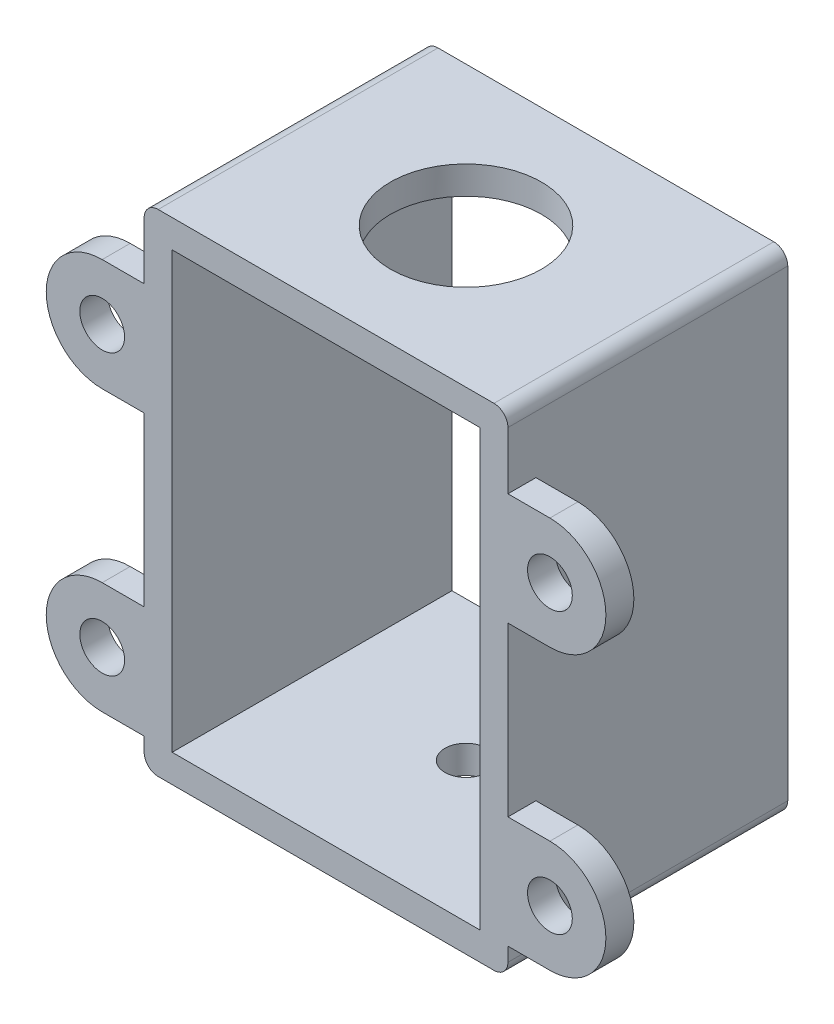
ISO-10303-21;
HEADER;
FILE_DESCRIPTION(('STEP AP214'),'2;1');
FILE_NAME('part.step','',(''),(''),'','','');
FILE_SCHEMA(('AUTOMOTIVE_DESIGN { 1 0 10303 214 1 1 1 1 }'));
ENDSEC;
DATA;
#1=APPLICATION_CONTEXT('core data for automotive mechanical design processes');
#2=APPLICATION_PROTOCOL_DEFINITION('international standard','automotive_design',2000,#1);
#3=PRODUCT_CONTEXT('',#1,'mechanical');
#4=PRODUCT('Part','Part','',(#3));
#5=PRODUCT_RELATED_PRODUCT_CATEGORY('part','',(#4));
#6=PRODUCT_DEFINITION_FORMATION('','',#4);
#7=PRODUCT_DEFINITION_CONTEXT('part definition',#1,'design');
#8=PRODUCT_DEFINITION('design','',#6,#7);
#9=PRODUCT_DEFINITION_SHAPE('','',#8);
#10=(LENGTH_UNIT() NAMED_UNIT(*) SI_UNIT(.MILLI.,.METRE.));
#11=(NAMED_UNIT(*) PLANE_ANGLE_UNIT() SI_UNIT($,.RADIAN.));
#12=(NAMED_UNIT(*) SI_UNIT($,.STERADIAN.) SOLID_ANGLE_UNIT());
#13=UNCERTAINTY_MEASURE_WITH_UNIT(LENGTH_MEASURE(1.E-05),#10,'distance_accuracy_value','');
#14=(GEOMETRIC_REPRESENTATION_CONTEXT(3) GLOBAL_UNCERTAINTY_ASSIGNED_CONTEXT((#13)) GLOBAL_UNIT_ASSIGNED_CONTEXT((#10,
#11,#12)) REPRESENTATION_CONTEXT('',''));
#15=CARTESIAN_POINT('',(0.,0.,0.));
#16=DIRECTION('',(0.,0.,1.));
#17=DIRECTION('',(1.,0.,0.));
#18=AXIS2_PLACEMENT_3D('',#15,#16,#17);
#19=CARTESIAN_POINT('',(0.,0.,20.));
#20=DIRECTION('',(0.,0.,-1.));
#21=DIRECTION('',(-1.,0.,0.));
#22=AXIS2_PLACEMENT_3D('',#19,#20,#21);
#23=PLANE('',#22);
#24=DIRECTION('',(1.,0.,0.));
#25=VECTOR('',#24,1.);
#26=CARTESIAN_POINT('',(0.,-31.1,20.));
#27=LINE('',#26,#25);
#28=CARTESIAN_POINT('',(0.,-31.1,20.));
#29=VERTEX_POINT('',#28);
#30=CARTESIAN_POINT('',(22.,-31.1,20.));
#31=VERTEX_POINT('',#30);
#32=EDGE_CURVE('E371',#29,#31,#27,.T.);
#33=ORIENTED_EDGE('',*,*,#32,.F.);
#34=DIRECTION('',(0.,-1.,0.));
#35=VECTOR('',#34,1.);
#36=CARTESIAN_POINT('',(0.,-31.5,20.));
#37=LINE('',#36,#35);
#38=CARTESIAN_POINT('',(0.,0.,20.));
#39=VERTEX_POINT('',#38);
#40=EDGE_CURVE('E384',#39,#29,#37,.T.);
#41=ORIENTED_EDGE('',*,*,#40,.F.);
#42=DIRECTION('',(-1.,0.,0.));
#43=VECTOR('',#42,1.);
#44=CARTESIAN_POINT('',(0.,0.,20.));
#45=LINE('',#44,#43);
#46=CARTESIAN_POINT('',(22.,0.,20.));
#47=VERTEX_POINT('',#46);
#48=EDGE_CURVE('E389',#47,#39,#45,.T.);
#49=ORIENTED_EDGE('',*,*,#48,.F.);
#50=DIRECTION('',(0.,1.,0.));
#51=VECTOR('',#50,1.);
#52=CARTESIAN_POINT('',(22.,0.,20.));
#53=LINE('',#52,#51);
#54=EDGE_CURVE('E386',#31,#47,#53,.T.);
#55=ORIENTED_EDGE('',*,*,#54,.F.);
#56=EDGE_LOOP('',(#33,#41,#49,#55));
#57=FACE_BOUND('',#56,.T.);
#58=DIRECTION('',(0.,-1.,0.));
#59=VECTOR('',#58,1.);
#60=CARTESIAN_POINT('',(-1.99999999999999,-33.5,20.));
#61=LINE('',#60,#59);
#62=CARTESIAN_POINT('',(-1.99999999999999,-11.1,20.));
#63=VERTEX_POINT('',#62);
#64=CARTESIAN_POINT('',(-1.99999999999999,-23.1,20.));
#65=VERTEX_POINT('',#64);
#66=EDGE_CURVE('E418',#63,#65,#61,.T.);
#67=ORIENTED_EDGE('',*,*,#66,.T.);
#68=DIRECTION('',(-1.,0.,0.));
#69=VECTOR('',#68,1.);
#70=CARTESIAN_POINT('',(-5.,-23.1,20.));
#71=LINE('',#70,#69);
#72=CARTESIAN_POINT('',(-5.,-23.1,20.));
#73=VERTEX_POINT('',#72);
#74=EDGE_CURVE('E241',#65,#73,#71,.T.);
#75=ORIENTED_EDGE('',*,*,#74,.T.);
#76=CARTESIAN_POINT('',(-5.,-27.1,20.));
#77=DIRECTION('',(0.,0.,1.));
#78=DIRECTION('',(-1.,0.,0.));
#79=AXIS2_PLACEMENT_3D('',#76,#77,#78);
#80=CIRCLE('',#79,4.);
#81=CARTESIAN_POINT('',(-5.,-31.1,20.));
#82=VERTEX_POINT('',#81);
#83=EDGE_CURVE('E249',#73,#82,#80,.T.);
#84=ORIENTED_EDGE('',*,*,#83,.T.);
#85=DIRECTION('',(1.,0.,0.));
#86=VECTOR('',#85,1.);
#87=CARTESIAN_POINT('',(0.,-31.1,20.));
#88=LINE('',#87,#86);
#89=CARTESIAN_POINT('',(-1.99999999999999,-31.1,20.));
#90=VERTEX_POINT('',#89);
#91=EDGE_CURVE('E48',#82,#90,#88,.T.);
#92=ORIENTED_EDGE('',*,*,#91,.T.);
#93=CARTESIAN_POINT('',(-1.99999999999999,-32.1,20.));
#94=VERTEX_POINT('',#93);
#95=EDGE_CURVE('E413',#90,#94,#61,.T.);
#96=ORIENTED_EDGE('',*,*,#95,.T.);
#97=CARTESIAN_POINT('',(-0.999999999999994,-32.1,20.));
#98=DIRECTION('',(0.,0.,-1.));
#99=DIRECTION('',(-1.,0.,0.));
#100=AXIS2_PLACEMENT_3D('',#97,#98,#99);
#101=CIRCLE('',#100,1.);
#102=CARTESIAN_POINT('',(-0.999999999999994,-33.1,20.));
#103=VERTEX_POINT('',#102);
#104=EDGE_CURVE('E436',#94,#103,#101,.F.);
#105=ORIENTED_EDGE('',*,*,#104,.T.);
#106=DIRECTION('',(-1.,0.,0.));
#107=VECTOR('',#106,1.);
#108=CARTESIAN_POINT('',(0.,-33.1,20.));
#109=LINE('',#108,#107);
#110=CARTESIAN_POINT('',(23.,-33.1,20.));
#111=VERTEX_POINT('',#110);
#112=EDGE_CURVE('E365',#111,#103,#109,.T.);
#113=ORIENTED_EDGE('',*,*,#112,.F.);
#114=CARTESIAN_POINT('',(23.,-32.1,20.));
#115=DIRECTION('',(0.,0.,-1.));
#116=DIRECTION('',(-1.,0.,0.));
#117=AXIS2_PLACEMENT_3D('',#114,#115,#116);
#118=CIRCLE('',#117,1.);
#119=CARTESIAN_POINT('',(24.,-32.1,20.));
#120=VERTEX_POINT('',#119);
#121=EDGE_CURVE('E442',#111,#120,#118,.F.);
#122=ORIENTED_EDGE('',*,*,#121,.T.);
#123=DIRECTION('',(0.,1.,0.));
#124=VECTOR('',#123,1.);
#125=CARTESIAN_POINT('',(24.,2.,20.));
#126=LINE('',#125,#124);
#127=CARTESIAN_POINT('',(24.,-31.1,20.));
#128=VERTEX_POINT('',#127);
#129=EDGE_CURVE('E405',#120,#128,#126,.T.);
#130=ORIENTED_EDGE('',*,*,#129,.T.);
#131=DIRECTION('',(1.,0.,0.));
#132=VECTOR('',#131,1.);
#133=CARTESIAN_POINT('',(22.,-31.1,20.));
#134=LINE('',#133,#132);
#135=CARTESIAN_POINT('',(27.,-31.1,20.));
#136=VERTEX_POINT('',#135);
#137=EDGE_CURVE('E331',#128,#136,#134,.T.);
#138=ORIENTED_EDGE('',*,*,#137,.T.);
#139=CARTESIAN_POINT('',(27.,-27.1,20.));
#140=DIRECTION('',(0.,0.,1.));
#141=DIRECTION('',(1.,0.,0.));
#142=AXIS2_PLACEMENT_3D('',#139,#140,#141);
#143=CIRCLE('',#142,4.);
#144=CARTESIAN_POINT('',(27.,-23.1,20.));
#145=VERTEX_POINT('',#144);
#146=EDGE_CURVE('E345',#136,#145,#143,.T.);
#147=ORIENTED_EDGE('',*,*,#146,.T.);
#148=DIRECTION('',(-1.,0.,0.));
#149=VECTOR('',#148,1.);
#150=CARTESIAN_POINT('',(27.,-23.1,20.));
#151=LINE('',#150,#149);
#152=CARTESIAN_POINT('',(24.,-23.1,20.));
#153=VERTEX_POINT('',#152);
#154=EDGE_CURVE('E337',#145,#153,#151,.T.);
#155=ORIENTED_EDGE('',*,*,#154,.T.);
#156=CARTESIAN_POINT('',(24.,-11.1,20.));
#157=VERTEX_POINT('',#156);
#158=EDGE_CURVE('E409',#153,#157,#126,.T.);
#159=ORIENTED_EDGE('',*,*,#158,.T.);
#160=DIRECTION('',(1.,0.,0.));
#161=VECTOR('',#160,1.);
#162=CARTESIAN_POINT('',(27.,-11.1,20.));
#163=LINE('',#162,#161);
#164=CARTESIAN_POINT('',(27.,-11.1,20.));
#165=VERTEX_POINT('',#164);
#166=EDGE_CURVE('E304',#157,#165,#163,.T.);
#167=ORIENTED_EDGE('',*,*,#166,.T.);
#168=CARTESIAN_POINT('',(27.,-7.1,20.));
#169=DIRECTION('',(0.,0.,1.));
#170=DIRECTION('',(1.,0.,0.));
#171=AXIS2_PLACEMENT_3D('',#168,#169,#170);
#172=CIRCLE('',#171,4.);
#173=CARTESIAN_POINT('',(27.,-3.1,20.));
#174=VERTEX_POINT('',#173);
#175=EDGE_CURVE('E297',#165,#174,#172,.T.);
#176=ORIENTED_EDGE('',*,*,#175,.T.);
#177=DIRECTION('',(-1.,0.,0.));
#178=VECTOR('',#177,1.);
#179=CARTESIAN_POINT('',(22.,-3.1,20.));
#180=LINE('',#179,#178);
#181=CARTESIAN_POINT('',(24.,-3.1,20.));
#182=VERTEX_POINT('',#181);
#183=EDGE_CURVE('E312',#174,#182,#180,.T.);
#184=ORIENTED_EDGE('',*,*,#183,.T.);
#185=CARTESIAN_POINT('',(24.,1.,20.));
#186=VERTEX_POINT('',#185);
#187=EDGE_CURVE('E410',#182,#186,#126,.T.);
#188=ORIENTED_EDGE('',*,*,#187,.T.);
#189=CARTESIAN_POINT('',(23.,1.,20.));
#190=DIRECTION('',(0.,0.,-1.));
#191=DIRECTION('',(-1.,0.,0.));
#192=AXIS2_PLACEMENT_3D('',#189,#190,#191);
#193=CIRCLE('',#192,1.);
#194=CARTESIAN_POINT('',(23.,2.,20.));
#195=VERTEX_POINT('',#194);
#196=EDGE_CURVE('E440',#186,#195,#193,.F.);
#197=ORIENTED_EDGE('',*,*,#196,.T.);
#198=DIRECTION('',(-1.,0.,0.));
#199=VECTOR('',#198,1.);
#200=CARTESIAN_POINT('',(22.,2.,20.));
#201=LINE('',#200,#199);
#202=CARTESIAN_POINT('',(-0.999999999999994,2.,20.));
#203=VERTEX_POINT('',#202);
#204=EDGE_CURVE('E408',#195,#203,#201,.T.);
#205=ORIENTED_EDGE('',*,*,#204,.T.);
#206=CARTESIAN_POINT('',(-0.999999999999995,1.,20.));
#207=DIRECTION('',(0.,0.,-1.));
#208=DIRECTION('',(-1.,0.,0.));
#209=AXIS2_PLACEMENT_3D('',#206,#207,#208);
#210=CIRCLE('',#209,1.);
#211=CARTESIAN_POINT('',(-1.99999999999999,1.,20.));
#212=VERTEX_POINT('',#211);
#213=EDGE_CURVE('E438',#203,#212,#210,.F.);
#214=ORIENTED_EDGE('',*,*,#213,.T.);
#215=CARTESIAN_POINT('',(-1.99999999999999,-3.1,20.));
#216=VERTEX_POINT('',#215);
#217=EDGE_CURVE('E414',#212,#216,#61,.T.);
#218=ORIENTED_EDGE('',*,*,#217,.T.);
#219=DIRECTION('',(-1.,0.,0.));
#220=VECTOR('',#219,1.);
#221=CARTESIAN_POINT('',(0.,-3.1,20.));
#222=LINE('',#221,#220);
#223=CARTESIAN_POINT('',(-5.,-3.1,20.));
#224=VERTEX_POINT('',#223);
#225=EDGE_CURVE('E271',#216,#224,#222,.T.);
#226=ORIENTED_EDGE('',*,*,#225,.T.);
#227=CARTESIAN_POINT('',(-5.,-7.1,20.));
#228=DIRECTION('',(0.,0.,1.));
#229=DIRECTION('',(-1.,0.,0.));
#230=AXIS2_PLACEMENT_3D('',#227,#228,#229);
#231=CIRCLE('',#230,4.);
#232=CARTESIAN_POINT('',(-5.,-11.1,20.));
#233=VERTEX_POINT('',#232);
#234=EDGE_CURVE('E264',#224,#233,#231,.T.);
#235=ORIENTED_EDGE('',*,*,#234,.T.);
#236=DIRECTION('',(1.,0.,0.));
#237=VECTOR('',#236,1.);
#238=CARTESIAN_POINT('',(-5.,-11.1,20.));
#239=LINE('',#238,#237);
#240=EDGE_CURVE('E55',#233,#63,#239,.T.);
#241=ORIENTED_EDGE('',*,*,#240,.T.);
#242=EDGE_LOOP('',(#67,#75,#84,#92,#96,#105,#113,#122,#130,#138,#147,#155,#159,#167,#176,#184,
#188,#197,#205,#214,#218,#226,#235,#241));
#243=FACE_BOUND('',#242,.T.);
#244=CARTESIAN_POINT('',(27.,-27.1,20.));
#245=DIRECTION('',(0.,0.,1.));
#246=DIRECTION('',(1.,0.,0.));
#247=AXIS2_PLACEMENT_3D('',#244,#245,#246);
#248=CIRCLE('',#247,1.6);
#249=CARTESIAN_POINT('',(28.6,-27.1,20.));
#250=VERTEX_POINT('',#249);
#251=EDGE_CURVE('E327',#250,#250,#248,.T.);
#252=ORIENTED_EDGE('',*,*,#251,.F.);
#253=EDGE_LOOP('',(#252));
#254=FACE_BOUND('',#253,.T.);
#255=CARTESIAN_POINT('',(27.,-7.1,20.));
#256=DIRECTION('',(0.,0.,1.));
#257=DIRECTION('',(1.,0.,0.));
#258=AXIS2_PLACEMENT_3D('',#255,#256,#257);
#259=CIRCLE('',#258,1.6);
#260=CARTESIAN_POINT('',(28.6,-7.1,20.));
#261=VERTEX_POINT('',#260);
#262=EDGE_CURVE('E293',#261,#261,#259,.T.);
#263=ORIENTED_EDGE('',*,*,#262,.F.);
#264=EDGE_LOOP('',(#263));
#265=FACE_BOUND('',#264,.T.);
#266=CARTESIAN_POINT('',(-5.,-7.1,20.));
#267=DIRECTION('',(0.,0.,1.));
#268=DIRECTION('',(-1.,0.,0.));
#269=AXIS2_PLACEMENT_3D('',#266,#267,#268);
#270=CIRCLE('',#269,1.59999999999999);
#271=CARTESIAN_POINT('',(-6.59999999999999,-7.1,20.));
#272=VERTEX_POINT('',#271);
#273=EDGE_CURVE('E260',#272,#272,#270,.T.);
#274=ORIENTED_EDGE('',*,*,#273,.F.);
#275=EDGE_LOOP('',(#274));
#276=FACE_BOUND('',#275,.T.);
#277=CARTESIAN_POINT('',(-5.,-27.1,20.));
#278=DIRECTION('',(0.,0.,1.));
#279=DIRECTION('',(-1.,0.,0.));
#280=AXIS2_PLACEMENT_3D('',#277,#278,#279);
#281=CIRCLE('',#280,1.59999999999999);
#282=CARTESIAN_POINT('',(-6.59999999999999,-27.1,20.));
#283=VERTEX_POINT('',#282);
#284=EDGE_CURVE('E245',#283,#283,#281,.T.);
#285=ORIENTED_EDGE('',*,*,#284,.F.);
#286=EDGE_LOOP('',(#285));
#287=FACE_BOUND('',#286,.T.);
#288=ADVANCED_FACE('F33',(#57,#243,#254,#265,#276,#287),#23,.F.);
#289=CARTESIAN_POINT('',(0.,0.,0.));
#290=DIRECTION('',(0.,0.,-1.));
#291=DIRECTION('',(-1.,0.,0.));
#292=AXIS2_PLACEMENT_3D('',#289,#290,#291);
#293=PLANE('',#292);
#294=DIRECTION('',(-1.,0.,0.));
#295=VECTOR('',#294,1.);
#296=CARTESIAN_POINT('',(0.,0.,0.));
#297=LINE('',#296,#295);
#298=CARTESIAN_POINT('',(22.,0.,0.));
#299=VERTEX_POINT('',#298);
#300=CARTESIAN_POINT('',(0.,0.,0.));
#301=VERTEX_POINT('',#300);
#302=EDGE_CURVE('E387',#299,#301,#297,.T.);
#303=ORIENTED_EDGE('',*,*,#302,.T.);
#304=DIRECTION('',(0.,-1.,0.));
#305=VECTOR('',#304,1.);
#306=CARTESIAN_POINT('',(0.,-31.5,0.));
#307=LINE('',#306,#305);
#308=CARTESIAN_POINT('',(0.,-31.1,0.));
#309=VERTEX_POINT('',#308);
#310=EDGE_CURVE('E392',#301,#309,#307,.T.);
#311=ORIENTED_EDGE('',*,*,#310,.T.);
#312=DIRECTION('',(-1.,0.,0.));
#313=VECTOR('',#312,1.);
#314=CARTESIAN_POINT('',(22.,-31.1,0.));
#315=LINE('',#314,#313);
#316=CARTESIAN_POINT('',(22.,-31.1,0.));
#317=VERTEX_POINT('',#316);
#318=EDGE_CURVE('E375',#317,#309,#315,.T.);
#319=ORIENTED_EDGE('',*,*,#318,.F.);
#320=DIRECTION('',(0.,1.,0.));
#321=VECTOR('',#320,1.);
#322=CARTESIAN_POINT('',(22.,0.,0.));
#323=LINE('',#322,#321);
#324=EDGE_CURVE('E395',#317,#299,#323,.T.);
#325=ORIENTED_EDGE('',*,*,#324,.T.);
#326=EDGE_LOOP('',(#303,#311,#319,#325));
#327=FACE_BOUND('',#326,.T.);
#328=DIRECTION('',(0.,1.,0.));
#329=VECTOR('',#328,1.);
#330=CARTESIAN_POINT('',(24.,2.,0.));
#331=LINE('',#330,#329);
#332=CARTESIAN_POINT('',(24.,-32.1,0.));
#333=VERTEX_POINT('',#332);
#334=CARTESIAN_POINT('',(24.,1.,0.));
#335=VERTEX_POINT('',#334);
#336=EDGE_CURVE('E404',#333,#335,#331,.T.);
#337=ORIENTED_EDGE('',*,*,#336,.F.);
#338=CARTESIAN_POINT('',(23.,-32.1,0.));
#339=DIRECTION('',(0.,0.,-1.));
#340=DIRECTION('',(-1.,0.,0.));
#341=AXIS2_PLACEMENT_3D('',#338,#339,#340);
#342=CIRCLE('',#341,1.);
#343=CARTESIAN_POINT('',(23.,-33.1,0.));
#344=VERTEX_POINT('',#343);
#345=EDGE_CURVE('E455',#333,#344,#342,.T.);
#346=ORIENTED_EDGE('',*,*,#345,.T.);
#347=DIRECTION('',(-1.,0.,0.));
#348=VECTOR('',#347,1.);
#349=CARTESIAN_POINT('',(0.,-33.1,0.));
#350=LINE('',#349,#348);
#351=CARTESIAN_POINT('',(-0.999999999999994,-33.1,0.));
#352=VERTEX_POINT('',#351);
#353=EDGE_CURVE('E362',#344,#352,#350,.T.);
#354=ORIENTED_EDGE('',*,*,#353,.T.);
#355=CARTESIAN_POINT('',(-0.999999999999994,-32.1,0.));
#356=DIRECTION('',(0.,0.,-1.));
#357=DIRECTION('',(-1.,0.,0.));
#358=AXIS2_PLACEMENT_3D('',#355,#356,#357);
#359=CIRCLE('',#358,1.);
#360=CARTESIAN_POINT('',(-1.99999999999999,-32.1,0.));
#361=VERTEX_POINT('',#360);
#362=EDGE_CURVE('E449',#352,#361,#359,.T.);
#363=ORIENTED_EDGE('',*,*,#362,.T.);
#364=DIRECTION('',(0.,-1.,0.));
#365=VECTOR('',#364,1.);
#366=CARTESIAN_POINT('',(-1.99999999999999,-33.5,0.));
#367=LINE('',#366,#365);
#368=CARTESIAN_POINT('',(-1.99999999999999,1.,0.));
#369=VERTEX_POINT('',#368);
#370=EDGE_CURVE('E424',#369,#361,#367,.T.);
#371=ORIENTED_EDGE('',*,*,#370,.F.);
#372=CARTESIAN_POINT('',(-0.999999999999995,1.,0.));
#373=DIRECTION('',(0.,0.,-1.));
#374=DIRECTION('',(-1.,0.,0.));
#375=AXIS2_PLACEMENT_3D('',#372,#373,#374);
#376=CIRCLE('',#375,1.);
#377=CARTESIAN_POINT('',(-0.999999999999995,2.,0.));
#378=VERTEX_POINT('',#377);
#379=EDGE_CURVE('E451',#369,#378,#376,.T.);
#380=ORIENTED_EDGE('',*,*,#379,.T.);
#381=DIRECTION('',(-1.,0.,0.));
#382=VECTOR('',#381,1.);
#383=CARTESIAN_POINT('',(-1.99999999999999,2.,0.));
#384=LINE('',#383,#382);
#385=CARTESIAN_POINT('',(23.,2.,0.));
#386=VERTEX_POINT('',#385);
#387=EDGE_CURVE('E421',#386,#378,#384,.T.);
#388=ORIENTED_EDGE('',*,*,#387,.F.);
#389=CARTESIAN_POINT('',(23.,1.,0.));
#390=DIRECTION('',(0.,0.,-1.));
#391=DIRECTION('',(-1.,0.,0.));
#392=AXIS2_PLACEMENT_3D('',#389,#390,#391);
#393=CIRCLE('',#392,1.);
#394=EDGE_CURVE('E453',#386,#335,#393,.T.);
#395=ORIENTED_EDGE('',*,*,#394,.T.);
#396=EDGE_LOOP('',(#337,#346,#354,#363,#371,#380,#388,#395));
#397=FACE_BOUND('',#396,.T.);
#398=ADVANCED_FACE('F517',(#327,#397),#293,.T.);
#399=CARTESIAN_POINT('',(24.,2.,20.));
#400=DIRECTION('',(-1.,0.,0.));
#401=DIRECTION('',(0.,-1.,0.));
#402=AXIS2_PLACEMENT_3D('',#399,#400,#401);
#403=PLANE('',#402);
#404=DIRECTION('',(0.,1.,0.));
#405=VECTOR('',#404,1.);
#406=CARTESIAN_POINT('',(24.,2.,18.));
#407=LINE('',#406,#405);
#408=CARTESIAN_POINT('',(24.,-11.1,18.));
#409=VERTEX_POINT('',#408);
#410=CARTESIAN_POINT('',(24.,-3.1,18.));
#411=VERTEX_POINT('',#410);
#412=EDGE_CURVE('E318',#409,#411,#407,.T.);
#413=ORIENTED_EDGE('',*,*,#412,.F.);
#414=DIRECTION('',(0.,0.,1.));
#415=VECTOR('',#414,1.);
#416=CARTESIAN_POINT('',(24.,-11.1,20.));
#417=LINE('',#416,#415);
#418=EDGE_CURVE('E324',#409,#157,#417,.T.);
#419=ORIENTED_EDGE('',*,*,#418,.T.);
#420=ORIENTED_EDGE('',*,*,#158,.F.);
#421=DIRECTION('',(0.,0.,-1.));
#422=VECTOR('',#421,1.);
#423=CARTESIAN_POINT('',(24.,-23.1,20.));
#424=LINE('',#423,#422);
#425=CARTESIAN_POINT('',(24.,-23.1,18.));
#426=VERTEX_POINT('',#425);
#427=EDGE_CURVE('E358',#153,#426,#424,.T.);
#428=ORIENTED_EDGE('',*,*,#427,.T.);
#429=DIRECTION('',(0.,1.,0.));
#430=VECTOR('',#429,1.);
#431=CARTESIAN_POINT('',(24.,2.,18.));
#432=LINE('',#431,#430);
#433=CARTESIAN_POINT('',(24.,-31.1,18.));
#434=VERTEX_POINT('',#433);
#435=EDGE_CURVE('E351',#434,#426,#432,.T.);
#436=ORIENTED_EDGE('',*,*,#435,.F.);
#437=DIRECTION('',(0.,0.,1.));
#438=VECTOR('',#437,1.);
#439=CARTESIAN_POINT('',(24.,-31.1,20.));
#440=LINE('',#439,#438);
#441=EDGE_CURVE('E355',#434,#128,#440,.T.);
#442=ORIENTED_EDGE('',*,*,#441,.T.);
#443=ORIENTED_EDGE('',*,*,#129,.F.);
#444=DIRECTION('',(0.,0.,1.));
#445=VECTOR('',#444,1.);
#446=CARTESIAN_POINT('',(24.,-32.1,0.));
#447=LINE('',#446,#445);
#448=EDGE_CURVE('E447',#120,#333,#447,.F.);
#449=ORIENTED_EDGE('',*,*,#448,.T.);
#450=ORIENTED_EDGE('',*,*,#336,.T.);
#451=DIRECTION('',(0.,0.,-1.));
#452=VECTOR('',#451,1.);
#453=CARTESIAN_POINT('',(24.,1.,20.));
#454=LINE('',#453,#452);
#455=EDGE_CURVE('E444',#335,#186,#454,.F.);
#456=ORIENTED_EDGE('',*,*,#455,.T.);
#457=ORIENTED_EDGE('',*,*,#187,.F.);
#458=DIRECTION('',(0.,0.,-1.));
#459=VECTOR('',#458,1.);
#460=CARTESIAN_POINT('',(24.,-3.1,20.));
#461=LINE('',#460,#459);
#462=EDGE_CURVE('E321',#182,#411,#461,.T.);
#463=ORIENTED_EDGE('',*,*,#462,.T.);
#464=EDGE_LOOP('',(#413,#419,#420,#428,#436,#442,#443,#449,#450,#456,#457,#463));
#465=FACE_BOUND('',#464,.T.);
#466=ADVANCED_FACE('F483',(#465),#403,.F.);
#467=CARTESIAN_POINT('',(-1.99999999999999,-33.5,20.));
#468=DIRECTION('',(1.,0.,0.));
#469=DIRECTION('',(0.,0.,-1.));
#470=AXIS2_PLACEMENT_3D('',#467,#468,#469);
#471=PLANE('',#470);
#472=DIRECTION('',(0.,1.,0.));
#473=VECTOR('',#472,1.);
#474=CARTESIAN_POINT('',(-1.99999999999999,-33.5,18.));
#475=LINE('',#474,#473);
#476=CARTESIAN_POINT('',(-1.99999999999999,-31.1,18.));
#477=VERTEX_POINT('',#476);
#478=CARTESIAN_POINT('',(-1.99999999999999,-23.1,18.));
#479=VERTEX_POINT('',#478);
#480=EDGE_CURVE('E236',#477,#479,#475,.T.);
#481=ORIENTED_EDGE('',*,*,#480,.T.);
#482=DIRECTION('',(0.,0.,1.));
#483=VECTOR('',#482,1.);
#484=CARTESIAN_POINT('',(-1.99999999999999,-23.1,20.));
#485=LINE('',#484,#483);
#486=EDGE_CURVE('E257',#479,#65,#485,.T.);
#487=ORIENTED_EDGE('',*,*,#486,.T.);
#488=ORIENTED_EDGE('',*,*,#66,.F.);
#489=DIRECTION('',(0.,0.,-1.));
#490=VECTOR('',#489,1.);
#491=CARTESIAN_POINT('',(-1.99999999999999,-11.1,20.));
#492=LINE('',#491,#490);
#493=CARTESIAN_POINT('',(-1.99999999999999,-11.1,18.));
#494=VERTEX_POINT('',#493);
#495=EDGE_CURVE('E287',#63,#494,#492,.T.);
#496=ORIENTED_EDGE('',*,*,#495,.T.);
#497=DIRECTION('',(0.,1.,0.));
#498=VECTOR('',#497,1.);
#499=CARTESIAN_POINT('',(-1.99999999999999,-33.5,18.));
#500=LINE('',#499,#498);
#501=CARTESIAN_POINT('',(-1.99999999999999,-3.1,18.));
#502=VERTEX_POINT('',#501);
#503=EDGE_CURVE('E283',#494,#502,#500,.T.);
#504=ORIENTED_EDGE('',*,*,#503,.T.);
#505=DIRECTION('',(0.,0.,1.));
#506=VECTOR('',#505,1.);
#507=CARTESIAN_POINT('',(-1.99999999999999,-3.1,20.));
#508=LINE('',#507,#506);
#509=EDGE_CURVE('E290',#502,#216,#508,.T.);
#510=ORIENTED_EDGE('',*,*,#509,.T.);
#511=ORIENTED_EDGE('',*,*,#217,.F.);
#512=DIRECTION('',(0.,0.,-1.));
#513=VECTOR('',#512,1.);
#514=CARTESIAN_POINT('',(-1.99999999999999,1.,20.));
#515=LINE('',#514,#513);
#516=EDGE_CURVE('E11',#212,#369,#515,.T.);
#517=ORIENTED_EDGE('',*,*,#516,.T.);
#518=ORIENTED_EDGE('',*,*,#370,.T.);
#519=DIRECTION('',(0.,0.,-1.));
#520=VECTOR('',#519,1.);
#521=CARTESIAN_POINT('',(-1.99999999999999,-32.1,20.));
#522=LINE('',#521,#520);
#523=EDGE_CURVE('E41',#361,#94,#522,.F.);
#524=ORIENTED_EDGE('',*,*,#523,.T.);
#525=ORIENTED_EDGE('',*,*,#95,.F.);
#526=DIRECTION('',(0.,0.,-1.));
#527=VECTOR('',#526,1.);
#528=CARTESIAN_POINT('',(-1.99999999999999,-31.1,20.));
#529=LINE('',#528,#527);
#530=EDGE_CURVE('E255',#90,#477,#529,.T.);
#531=ORIENTED_EDGE('',*,*,#530,.T.);
#532=EDGE_LOOP('',(#481,#487,#488,#496,#504,#510,#511,#517,#518,#524,#525,#531));
#533=FACE_BOUND('',#532,.T.);
#534=ADVANCED_FACE('F466',(#533),#471,.F.);
#535=CARTESIAN_POINT('',(11.,-13.5,10.));
#536=DIRECTION('',(0.,-1.,0.));
#537=DIRECTION('',(0.,0.,-1.));
#538=AXIS2_PLACEMENT_3D('',#535,#536,#537);
#539=CYLINDRICAL_SURFACE('',#538,1.5);
#540=CARTESIAN_POINT('',(11.,-31.1,10.));
#541=DIRECTION('',(0.,1.,0.));
#542=DIRECTION('',(0.,0.,1.));
#543=AXIS2_PLACEMENT_3D('',#540,#541,#542);
#544=CIRCLE('',#543,1.5);
#545=CARTESIAN_POINT('',(11.,-31.1,11.5));
#546=VERTEX_POINT('',#545);
#547=EDGE_CURVE('E368',#546,#546,#544,.T.);
#548=ORIENTED_EDGE('',*,*,#547,.T.);
#549=EDGE_LOOP('',(#548));
#550=FACE_BOUND('',#549,.T.);
#551=CARTESIAN_POINT('',(11.,-33.1,10.));
#552=DIRECTION('',(0.,-1.,0.));
#553=DIRECTION('',(0.,0.,-1.));
#554=AXIS2_PLACEMENT_3D('',#551,#552,#553);
#555=CIRCLE('',#554,1.5);
#556=CARTESIAN_POINT('',(11.,-33.1,8.5));
#557=VERTEX_POINT('',#556);
#558=EDGE_CURVE('E361',#557,#557,#555,.F.);
#559=ORIENTED_EDGE('',*,*,#558,.F.);
#560=EDGE_LOOP('',(#559));
#561=FACE_BOUND('',#560,.T.);
#562=ADVANCED_FACE('F563',(#550,#561),#539,.F.);
#563=CARTESIAN_POINT('',(-1.99999999999999,2.,20.));
#564=DIRECTION('',(0.,-1.,0.));
#565=DIRECTION('',(0.,0.,-1.));
#566=AXIS2_PLACEMENT_3D('',#563,#564,#565);
#567=PLANE('',#566);
#568=CARTESIAN_POINT('',(11.,2.,10.));
#569=DIRECTION('',(0.,1.,0.));
#570=DIRECTION('',(0.,0.,1.));
#571=AXIS2_PLACEMENT_3D('',#568,#569,#570);
#572=CIRCLE('',#571,5.4);
#573=CARTESIAN_POINT('',(11.,2.,15.4));
#574=VERTEX_POINT('',#573);
#575=EDGE_CURVE('E380',#574,#574,#572,.T.);
#576=ORIENTED_EDGE('',*,*,#575,.F.);
#577=EDGE_LOOP('',(#576));
#578=FACE_BOUND('',#577,.T.);
#579=ORIENTED_EDGE('',*,*,#204,.F.);
#580=DIRECTION('',(0.,0.,-1.));
#581=VECTOR('',#580,1.);
#582=CARTESIAN_POINT('',(23.,2.,20.));
#583=LINE('',#582,#581);
#584=EDGE_CURVE('E459',#195,#386,#583,.T.);
#585=ORIENTED_EDGE('',*,*,#584,.T.);
#586=ORIENTED_EDGE('',*,*,#387,.T.);
#587=DIRECTION('',(0.,0.,-1.));
#588=VECTOR('',#587,1.);
#589=CARTESIAN_POINT('',(-0.999999999999995,2.,20.));
#590=LINE('',#589,#588);
#591=EDGE_CURVE('E457',#378,#203,#590,.F.);
#592=ORIENTED_EDGE('',*,*,#591,.T.);
#593=EDGE_LOOP('',(#579,#585,#586,#592));
#594=FACE_BOUND('',#593,.T.);
#595=ADVANCED_FACE('F514',(#578,#594),#567,.F.);
#596=CARTESIAN_POINT('',(0.,-31.5,20.));
#597=DIRECTION('',(1.,0.,0.));
#598=DIRECTION('',(0.,0.,-1.));
#599=AXIS2_PLACEMENT_3D('',#596,#597,#598);
#600=PLANE('',#599);
#601=ORIENTED_EDGE('',*,*,#40,.T.);
#602=DIRECTION('',(0.,0.,1.));
#603=VECTOR('',#602,1.);
#604=CARTESIAN_POINT('',(0.,-31.1,0.));
#605=LINE('',#604,#603);
#606=EDGE_CURVE('E377',#309,#29,#605,.T.);
#607=ORIENTED_EDGE('',*,*,#606,.F.);
#608=ORIENTED_EDGE('',*,*,#310,.F.);
#609=DIRECTION('',(0.,0.,-1.));
#610=VECTOR('',#609,1.);
#611=CARTESIAN_POINT('',(0.,0.,20.));
#612=LINE('',#611,#610);
#613=EDGE_CURVE('E391',#39,#301,#612,.T.);
#614=ORIENTED_EDGE('',*,*,#613,.F.);
#615=EDGE_LOOP('',(#601,#607,#608,#614));
#616=FACE_BOUND('',#615,.T.);
#617=ADVANCED_FACE('F558',(#616),#600,.T.);
#618=CARTESIAN_POINT('',(22.,0.,20.));
#619=DIRECTION('',(-1.,0.,0.));
#620=DIRECTION('',(0.,-1.,0.));
#621=AXIS2_PLACEMENT_3D('',#618,#619,#620);
#622=PLANE('',#621);
#623=ORIENTED_EDGE('',*,*,#54,.T.);
#624=DIRECTION('',(0.,0.,-1.));
#625=VECTOR('',#624,1.);
#626=CARTESIAN_POINT('',(22.,0.,20.));
#627=LINE('',#626,#625);
#628=EDGE_CURVE('E401',#47,#299,#627,.T.);
#629=ORIENTED_EDGE('',*,*,#628,.T.);
#630=ORIENTED_EDGE('',*,*,#324,.F.);
#631=DIRECTION('',(0.,0.,-1.));
#632=VECTOR('',#631,1.);
#633=CARTESIAN_POINT('',(22.,-31.1,20.));
#634=LINE('',#633,#632);
#635=EDGE_CURVE('E373',#31,#317,#634,.T.);
#636=ORIENTED_EDGE('',*,*,#635,.F.);
#637=EDGE_LOOP('',(#623,#629,#630,#636));
#638=FACE_BOUND('',#637,.T.);
#639=ADVANCED_FACE('F606',(#638),#622,.T.);
#640=CARTESIAN_POINT('',(0.,0.,20.));
#641=DIRECTION('',(0.,-1.,0.));
#642=DIRECTION('',(0.,0.,-1.));
#643=AXIS2_PLACEMENT_3D('',#640,#641,#642);
#644=PLANE('',#643);
#645=CARTESIAN_POINT('',(11.,0.,10.));
#646=DIRECTION('',(0.,-1.,0.));
#647=DIRECTION('',(0.,0.,-1.));
#648=AXIS2_PLACEMENT_3D('',#645,#646,#647);
#649=CIRCLE('',#648,5.4);
#650=CARTESIAN_POINT('',(11.,0.,4.6));
#651=VERTEX_POINT('',#650);
#652=EDGE_CURVE('E383',#651,#651,#649,.T.);
#653=ORIENTED_EDGE('',*,*,#652,.F.);
#654=EDGE_LOOP('',(#653));
#655=FACE_BOUND('',#654,.T.);
#656=ORIENTED_EDGE('',*,*,#302,.F.);
#657=ORIENTED_EDGE('',*,*,#628,.F.);
#658=ORIENTED_EDGE('',*,*,#48,.T.);
#659=ORIENTED_EDGE('',*,*,#613,.T.);
#660=EDGE_LOOP('',(#656,#657,#658,#659));
#661=FACE_BOUND('',#660,.T.);
#662=ADVANCED_FACE('F603',(#655,#661),#644,.T.);
#663=CARTESIAN_POINT('',(11.,-18.,10.));
#664=DIRECTION('',(0.,1.,0.));
#665=DIRECTION('',(0.,0.,1.));
#666=AXIS2_PLACEMENT_3D('',#663,#664,#665);
#667=CYLINDRICAL_SURFACE('',#666,5.4);
#668=ORIENTED_EDGE('',*,*,#652,.T.);
#669=EDGE_LOOP('',(#668));
#670=FACE_BOUND('',#669,.T.);
#671=ORIENTED_EDGE('',*,*,#575,.T.);
#672=EDGE_LOOP('',(#671));
#673=FACE_BOUND('',#672,.T.);
#674=ADVANCED_FACE('F596',(#670,#673),#667,.F.);
#675=CARTESIAN_POINT('',(0.,-31.1,0.));
#676=DIRECTION('',(0.,1.,0.));
#677=DIRECTION('',(0.,0.,1.));
#678=AXIS2_PLACEMENT_3D('',#675,#676,#677);
#679=PLANE('',#678);
#680=ORIENTED_EDGE('',*,*,#32,.T.);
#681=ORIENTED_EDGE('',*,*,#635,.T.);
#682=ORIENTED_EDGE('',*,*,#318,.T.);
#683=ORIENTED_EDGE('',*,*,#606,.T.);
#684=EDGE_LOOP('',(#680,#681,#682,#683));
#685=FACE_BOUND('',#684,.T.);
#686=ORIENTED_EDGE('',*,*,#547,.F.);
#687=EDGE_LOOP('',(#686));
#688=FACE_BOUND('',#687,.T.);
#689=ADVANCED_FACE('F592',(#685,#688),#679,.T.);
#690=CARTESIAN_POINT('',(11.,-33.1,10.));
#691=DIRECTION('',(0.,-1.,0.));
#692=DIRECTION('',(0.,0.,-1.));
#693=AXIS2_PLACEMENT_3D('',#690,#691,#692);
#694=PLANE('',#693);
#695=ORIENTED_EDGE('',*,*,#558,.T.);
#696=EDGE_LOOP('',(#695));
#697=FACE_BOUND('',#696,.T.);
#698=ORIENTED_EDGE('',*,*,#353,.F.);
#699=DIRECTION('',(0.,0.,1.));
#700=VECTOR('',#699,1.);
#701=CARTESIAN_POINT('',(23.,-33.1,20.));
#702=LINE('',#701,#700);
#703=EDGE_CURVE('E433',#344,#111,#702,.T.);
#704=ORIENTED_EDGE('',*,*,#703,.T.);
#705=ORIENTED_EDGE('',*,*,#112,.T.);
#706=DIRECTION('',(0.,0.,-1.));
#707=VECTOR('',#706,1.);
#708=CARTESIAN_POINT('',(-0.999999999999994,-33.1,0.));
#709=LINE('',#708,#707);
#710=EDGE_CURVE('E417',#103,#352,#709,.T.);
#711=ORIENTED_EDGE('',*,*,#710,.T.);
#712=EDGE_LOOP('',(#698,#704,#705,#711));
#713=FACE_BOUND('',#712,.T.);
#714=ADVANCED_FACE('F474',(#697,#713),#694,.T.);
#715=CARTESIAN_POINT('',(23.,-32.1,10.));
#716=DIRECTION('',(0.,0.,-1.));
#717=DIRECTION('',(-1.,0.,0.));
#718=AXIS2_PLACEMENT_3D('',#715,#716,#717);
#719=CYLINDRICAL_SURFACE('',#718,1.);
#720=ORIENTED_EDGE('',*,*,#345,.F.);
#721=ORIENTED_EDGE('',*,*,#448,.F.);
#722=ORIENTED_EDGE('',*,*,#121,.F.);
#723=ORIENTED_EDGE('',*,*,#703,.F.);
#724=EDGE_LOOP('',(#720,#721,#722,#723));
#725=FACE_BOUND('',#724,.T.);
#726=ADVANCED_FACE('F478',(#725),#719,.T.);
#727=CARTESIAN_POINT('',(23.,1.,20.));
#728=DIRECTION('',(0.,0.,-1.));
#729=DIRECTION('',(-1.,0.,0.));
#730=AXIS2_PLACEMENT_3D('',#727,#728,#729);
#731=CYLINDRICAL_SURFACE('',#730,1.);
#732=ORIENTED_EDGE('',*,*,#196,.F.);
#733=ORIENTED_EDGE('',*,*,#455,.F.);
#734=ORIENTED_EDGE('',*,*,#394,.F.);
#735=ORIENTED_EDGE('',*,*,#584,.F.);
#736=EDGE_LOOP('',(#732,#733,#734,#735));
#737=FACE_BOUND('',#736,.T.);
#738=ADVANCED_FACE('F511',(#737),#731,.T.);
#739=CARTESIAN_POINT('',(-0.999999999999995,1.,20.));
#740=DIRECTION('',(0.,0.,-1.));
#741=DIRECTION('',(-1.,0.,0.));
#742=AXIS2_PLACEMENT_3D('',#739,#740,#741);
#743=CYLINDRICAL_SURFACE('',#742,1.);
#744=ORIENTED_EDGE('',*,*,#213,.F.);
#745=ORIENTED_EDGE('',*,*,#591,.F.);
#746=ORIENTED_EDGE('',*,*,#379,.F.);
#747=ORIENTED_EDGE('',*,*,#516,.F.);
#748=EDGE_LOOP('',(#744,#745,#746,#747));
#749=FACE_BOUND('',#748,.T.);
#750=ADVANCED_FACE('F521',(#749),#743,.T.);
#751=CARTESIAN_POINT('',(-0.999999999999994,-32.1,10.));
#752=DIRECTION('',(0.,0.,1.));
#753=DIRECTION('',(1.,0.,0.));
#754=AXIS2_PLACEMENT_3D('',#751,#752,#753);
#755=CYLINDRICAL_SURFACE('',#754,1.);
#756=ORIENTED_EDGE('',*,*,#104,.F.);
#757=ORIENTED_EDGE('',*,*,#523,.F.);
#758=ORIENTED_EDGE('',*,*,#362,.F.);
#759=ORIENTED_EDGE('',*,*,#710,.F.);
#760=EDGE_LOOP('',(#756,#757,#758,#759));
#761=FACE_BOUND('',#760,.T.);
#762=ADVANCED_FACE('F35',(#761),#755,.T.);
#763=CARTESIAN_POINT('',(27.,-23.1,18.));
#764=DIRECTION('',(0.,1.,0.));
#765=DIRECTION('',(0.,0.,1.));
#766=AXIS2_PLACEMENT_3D('',#763,#764,#765);
#767=PLANE('',#766);
#768=ORIENTED_EDGE('',*,*,#427,.F.);
#769=ORIENTED_EDGE('',*,*,#154,.F.);
#770=DIRECTION('',(0.,0.,1.));
#771=VECTOR('',#770,1.);
#772=CARTESIAN_POINT('',(27.,-23.1,18.));
#773=LINE('',#772,#771);
#774=CARTESIAN_POINT('',(27.,-23.1,18.));
#775=VERTEX_POINT('',#774);
#776=EDGE_CURVE('E349',#775,#145,#773,.T.);
#777=ORIENTED_EDGE('',*,*,#776,.F.);
#778=DIRECTION('',(-1.,0.,0.));
#779=VECTOR('',#778,1.);
#780=CARTESIAN_POINT('',(27.,-23.1,18.));
#781=LINE('',#780,#779);
#782=EDGE_CURVE('E340',#775,#426,#781,.T.);
#783=ORIENTED_EDGE('',*,*,#782,.T.);
#784=EDGE_LOOP('',(#768,#769,#777,#783));
#785=FACE_BOUND('',#784,.T.);
#786=ADVANCED_FACE('F501',(#785),#767,.T.);
#787=CARTESIAN_POINT('',(22.,-31.1,18.));
#788=DIRECTION('',(0.,-1.,0.));
#789=DIRECTION('',(0.,0.,-1.));
#790=AXIS2_PLACEMENT_3D('',#787,#788,#789);
#791=PLANE('',#790);
#792=ORIENTED_EDGE('',*,*,#441,.F.);
#793=DIRECTION('',(1.,0.,0.));
#794=VECTOR('',#793,1.);
#795=CARTESIAN_POINT('',(22.,-31.1,18.));
#796=LINE('',#795,#794);
#797=CARTESIAN_POINT('',(27.,-31.1,18.));
#798=VERTEX_POINT('',#797);
#799=EDGE_CURVE('E334',#434,#798,#796,.T.);
#800=ORIENTED_EDGE('',*,*,#799,.T.);
#801=DIRECTION('',(0.,0.,1.));
#802=VECTOR('',#801,1.);
#803=CARTESIAN_POINT('',(27.,-31.1,18.));
#804=LINE('',#803,#802);
#805=EDGE_CURVE('E343',#798,#136,#804,.T.);
#806=ORIENTED_EDGE('',*,*,#805,.T.);
#807=ORIENTED_EDGE('',*,*,#137,.F.);
#808=EDGE_LOOP('',(#792,#800,#806,#807));
#809=FACE_BOUND('',#808,.T.);
#810=ADVANCED_FACE('F488',(#809),#791,.T.);
#811=CARTESIAN_POINT('',(27.,-27.1,18.));
#812=DIRECTION('',(0.,0.,1.));
#813=DIRECTION('',(1.,0.,0.));
#814=AXIS2_PLACEMENT_3D('',#811,#812,#813);
#815=PLANE('',#814);
#816=CARTESIAN_POINT('',(27.,-27.1,18.));
#817=DIRECTION('',(0.,0.,1.));
#818=DIRECTION('',(1.,0.,0.));
#819=AXIS2_PLACEMENT_3D('',#816,#817,#818);
#820=CIRCLE('',#819,1.6);
#821=CARTESIAN_POINT('',(28.6,-27.1,18.));
#822=VERTEX_POINT('',#821);
#823=EDGE_CURVE('E328',#822,#822,#820,.T.);
#824=ORIENTED_EDGE('',*,*,#823,.T.);
#825=EDGE_LOOP('',(#824));
#826=FACE_BOUND('',#825,.T.);
#827=ORIENTED_EDGE('',*,*,#799,.F.);
#828=ORIENTED_EDGE('',*,*,#435,.T.);
#829=ORIENTED_EDGE('',*,*,#782,.F.);
#830=CARTESIAN_POINT('',(27.,-27.1,18.));
#831=DIRECTION('',(0.,0.,1.));
#832=DIRECTION('',(1.,0.,0.));
#833=AXIS2_PLACEMENT_3D('',#830,#831,#832);
#834=CIRCLE('',#833,4.);
#835=EDGE_CURVE('E336',#798,#775,#834,.T.);
#836=ORIENTED_EDGE('',*,*,#835,.F.);
#837=EDGE_LOOP('',(#827,#828,#829,#836));
#838=FACE_BOUND('',#837,.T.);
#839=ADVANCED_FACE('F492',(#826,#838),#815,.F.);
#840=CARTESIAN_POINT('',(27.,-27.1,18.));
#841=DIRECTION('',(0.,0.,1.));
#842=DIRECTION('',(1.,0.,0.));
#843=AXIS2_PLACEMENT_3D('',#840,#841,#842);
#844=CYLINDRICAL_SURFACE('',#843,4.);
#845=ORIENTED_EDGE('',*,*,#146,.F.);
#846=ORIENTED_EDGE('',*,*,#805,.F.);
#847=ORIENTED_EDGE('',*,*,#835,.T.);
#848=ORIENTED_EDGE('',*,*,#776,.T.);
#849=EDGE_LOOP('',(#845,#846,#847,#848));
#850=FACE_BOUND('',#849,.T.);
#851=ADVANCED_FACE('F496',(#850),#844,.T.);
#852=CARTESIAN_POINT('',(27.,-27.1,18.));
#853=DIRECTION('',(0.,0.,1.));
#854=DIRECTION('',(1.,0.,0.));
#855=AXIS2_PLACEMENT_3D('',#852,#853,#854);
#856=CYLINDRICAL_SURFACE('',#855,1.6);
#857=ORIENTED_EDGE('',*,*,#823,.F.);
#858=EDGE_LOOP('',(#857));
#859=FACE_BOUND('',#858,.T.);
#860=ORIENTED_EDGE('',*,*,#251,.T.);
#861=EDGE_LOOP('',(#860));
#862=FACE_BOUND('',#861,.T.);
#863=ADVANCED_FACE('F588',(#859,#862),#856,.F.);
#864=CARTESIAN_POINT('',(27.,-11.1,18.));
#865=DIRECTION('',(0.,-1.,0.));
#866=DIRECTION('',(0.,0.,-1.));
#867=AXIS2_PLACEMENT_3D('',#864,#865,#866);
#868=PLANE('',#867);
#869=ORIENTED_EDGE('',*,*,#418,.F.);
#870=DIRECTION('',(1.,0.,0.));
#871=VECTOR('',#870,1.);
#872=CARTESIAN_POINT('',(27.,-11.1,18.));
#873=LINE('',#872,#871);
#874=CARTESIAN_POINT('',(27.,-11.1,18.));
#875=VERTEX_POINT('',#874);
#876=EDGE_CURVE('E307',#409,#875,#873,.T.);
#877=ORIENTED_EDGE('',*,*,#876,.T.);
#878=DIRECTION('',(0.,0.,1.));
#879=VECTOR('',#878,1.);
#880=CARTESIAN_POINT('',(27.,-11.1,18.));
#881=LINE('',#880,#879);
#882=EDGE_CURVE('E315',#875,#165,#881,.T.);
#883=ORIENTED_EDGE('',*,*,#882,.T.);
#884=ORIENTED_EDGE('',*,*,#166,.F.);
#885=EDGE_LOOP('',(#869,#877,#883,#884));
#886=FACE_BOUND('',#885,.T.);
#887=ADVANCED_FACE('F727',(#886),#868,.T.);
#888=CARTESIAN_POINT('',(22.,-3.1,18.));
#889=DIRECTION('',(0.,1.,0.));
#890=DIRECTION('',(-1.,0.,0.));
#891=AXIS2_PLACEMENT_3D('',#888,#889,#890);
#892=PLANE('',#891);
#893=ORIENTED_EDGE('',*,*,#462,.F.);
#894=ORIENTED_EDGE('',*,*,#183,.F.);
#895=DIRECTION('',(0.,0.,1.));
#896=VECTOR('',#895,1.);
#897=CARTESIAN_POINT('',(27.,-3.1,18.));
#898=LINE('',#897,#896);
#899=CARTESIAN_POINT('',(27.,-3.1,18.));
#900=VERTEX_POINT('',#899);
#901=EDGE_CURVE('E309',#900,#174,#898,.T.);
#902=ORIENTED_EDGE('',*,*,#901,.F.);
#903=DIRECTION('',(-1.,0.,0.));
#904=VECTOR('',#903,1.);
#905=CARTESIAN_POINT('',(22.,-3.1,18.));
#906=LINE('',#905,#904);
#907=EDGE_CURVE('E303',#900,#411,#906,.T.);
#908=ORIENTED_EDGE('',*,*,#907,.T.);
#909=EDGE_LOOP('',(#893,#894,#902,#908));
#910=FACE_BOUND('',#909,.T.);
#911=ADVANCED_FACE('F735',(#910),#892,.T.);
#912=CARTESIAN_POINT('',(27.,-7.1,18.));
#913=DIRECTION('',(0.,0.,1.));
#914=DIRECTION('',(1.,0.,0.));
#915=AXIS2_PLACEMENT_3D('',#912,#913,#914);
#916=PLANE('',#915);
#917=CARTESIAN_POINT('',(27.,-7.1,18.));
#918=DIRECTION('',(0.,0.,1.));
#919=DIRECTION('',(1.,0.,0.));
#920=AXIS2_PLACEMENT_3D('',#917,#918,#919);
#921=CIRCLE('',#920,1.6);
#922=CARTESIAN_POINT('',(28.6,-7.1,18.));
#923=VERTEX_POINT('',#922);
#924=EDGE_CURVE('E294',#923,#923,#921,.T.);
#925=ORIENTED_EDGE('',*,*,#924,.T.);
#926=EDGE_LOOP('',(#925));
#927=FACE_BOUND('',#926,.T.);
#928=ORIENTED_EDGE('',*,*,#876,.F.);
#929=ORIENTED_EDGE('',*,*,#412,.T.);
#930=ORIENTED_EDGE('',*,*,#907,.F.);
#931=CARTESIAN_POINT('',(27.,-7.1,18.));
#932=DIRECTION('',(0.,0.,1.));
#933=DIRECTION('',(1.,0.,0.));
#934=AXIS2_PLACEMENT_3D('',#931,#932,#933);
#935=CIRCLE('',#934,4.);
#936=EDGE_CURVE('E300',#875,#900,#935,.T.);
#937=ORIENTED_EDGE('',*,*,#936,.F.);
#938=EDGE_LOOP('',(#928,#929,#930,#937));
#939=FACE_BOUND('',#938,.T.);
#940=ADVANCED_FACE('F744',(#927,#939),#916,.F.);
#941=CARTESIAN_POINT('',(27.,-7.1,18.));
#942=DIRECTION('',(0.,0.,1.));
#943=DIRECTION('',(1.,0.,0.));
#944=AXIS2_PLACEMENT_3D('',#941,#942,#943);
#945=CYLINDRICAL_SURFACE('',#944,4.);
#946=ORIENTED_EDGE('',*,*,#175,.F.);
#947=ORIENTED_EDGE('',*,*,#882,.F.);
#948=ORIENTED_EDGE('',*,*,#936,.T.);
#949=ORIENTED_EDGE('',*,*,#901,.T.);
#950=EDGE_LOOP('',(#946,#947,#948,#949));
#951=FACE_BOUND('',#950,.T.);
#952=ADVANCED_FACE('F753',(#951),#945,.T.);
#953=CARTESIAN_POINT('',(27.,-7.1,18.));
#954=DIRECTION('',(0.,0.,1.));
#955=DIRECTION('',(1.,0.,0.));
#956=AXIS2_PLACEMENT_3D('',#953,#954,#955);
#957=CYLINDRICAL_SURFACE('',#956,1.6);
#958=ORIENTED_EDGE('',*,*,#924,.F.);
#959=EDGE_LOOP('',(#958));
#960=FACE_BOUND('',#959,.T.);
#961=ORIENTED_EDGE('',*,*,#262,.T.);
#962=EDGE_LOOP('',(#961));
#963=FACE_BOUND('',#962,.T.);
#964=ADVANCED_FACE('F762',(#960,#963),#957,.F.);
#965=CARTESIAN_POINT('',(0.,-3.1,18.));
#966=DIRECTION('',(0.,1.,0.));
#967=DIRECTION('',(-1.,0.,0.));
#968=AXIS2_PLACEMENT_3D('',#965,#966,#967);
#969=PLANE('',#968);
#970=ORIENTED_EDGE('',*,*,#509,.F.);
#971=DIRECTION('',(-1.,0.,0.));
#972=VECTOR('',#971,1.);
#973=CARTESIAN_POINT('',(0.,-3.1,18.));
#974=LINE('',#973,#972);
#975=CARTESIAN_POINT('',(-5.,-3.1,18.));
#976=VERTEX_POINT('',#975);
#977=EDGE_CURVE('E274',#502,#976,#974,.T.);
#978=ORIENTED_EDGE('',*,*,#977,.T.);
#979=DIRECTION('',(0.,0.,1.));
#980=VECTOR('',#979,1.);
#981=CARTESIAN_POINT('',(-5.,-3.1,18.));
#982=LINE('',#981,#980);
#983=EDGE_CURVE('E280',#976,#224,#982,.T.);
#984=ORIENTED_EDGE('',*,*,#983,.T.);
#985=ORIENTED_EDGE('',*,*,#225,.F.);
#986=EDGE_LOOP('',(#970,#978,#984,#985));
#987=FACE_BOUND('',#986,.T.);
#988=ADVANCED_FACE('F526',(#987),#969,.T.);
#989=CARTESIAN_POINT('',(-5.,-11.1,18.));
#990=DIRECTION('',(0.,-1.,0.));
#991=DIRECTION('',(0.,0.,-1.));
#992=AXIS2_PLACEMENT_3D('',#989,#990,#991);
#993=PLANE('',#992);
#994=ORIENTED_EDGE('',*,*,#495,.F.);
#995=ORIENTED_EDGE('',*,*,#240,.F.);
#996=DIRECTION('',(0.,0.,1.));
#997=VECTOR('',#996,1.);
#998=CARTESIAN_POINT('',(-5.,-11.1,18.));
#999=LINE('',#998,#997);
#1000=CARTESIAN_POINT('',(-5.,-11.1,18.));
#1001=VERTEX_POINT('',#1000);
#1002=EDGE_CURVE('E276',#1001,#233,#999,.T.);
#1003=ORIENTED_EDGE('',*,*,#1002,.F.);
#1004=DIRECTION('',(1.,0.,0.));
#1005=VECTOR('',#1004,1.);
#1006=CARTESIAN_POINT('',(-5.,-11.1,18.));
#1007=LINE('',#1006,#1005);
#1008=EDGE_CURVE('E270',#1001,#494,#1007,.T.);
#1009=ORIENTED_EDGE('',*,*,#1008,.T.);
#1010=EDGE_LOOP('',(#994,#995,#1003,#1009));
#1011=FACE_BOUND('',#1010,.T.);
#1012=ADVANCED_FACE('F533',(#1011),#993,.T.);
#1013=CARTESIAN_POINT('',(-5.,-7.1,18.));
#1014=DIRECTION('',(0.,0.,-1.));
#1015=DIRECTION('',(-1.,0.,0.));
#1016=AXIS2_PLACEMENT_3D('',#1013,#1014,#1015);
#1017=PLANE('',#1016);
#1018=CARTESIAN_POINT('',(-5.,-7.1,18.));
#1019=DIRECTION('',(0.,0.,1.));
#1020=DIRECTION('',(-1.,0.,0.));
#1021=AXIS2_PLACEMENT_3D('',#1018,#1019,#1020);
#1022=CIRCLE('',#1021,1.59999999999999);
#1023=CARTESIAN_POINT('',(-6.59999999999999,-7.1,18.));
#1024=VERTEX_POINT('',#1023);
#1025=EDGE_CURVE('E261',#1024,#1024,#1022,.T.);
#1026=ORIENTED_EDGE('',*,*,#1025,.T.);
#1027=EDGE_LOOP('',(#1026));
#1028=FACE_BOUND('',#1027,.T.);
#1029=ORIENTED_EDGE('',*,*,#503,.F.);
#1030=ORIENTED_EDGE('',*,*,#1008,.F.);
#1031=CARTESIAN_POINT('',(-5.,-7.1,18.));
#1032=DIRECTION('',(0.,0.,1.));
#1033=DIRECTION('',(-1.,0.,0.));
#1034=AXIS2_PLACEMENT_3D('',#1031,#1032,#1033);
#1035=CIRCLE('',#1034,4.);
#1036=EDGE_CURVE('E267',#976,#1001,#1035,.T.);
#1037=ORIENTED_EDGE('',*,*,#1036,.F.);
#1038=ORIENTED_EDGE('',*,*,#977,.F.);
#1039=EDGE_LOOP('',(#1029,#1030,#1037,#1038));
#1040=FACE_BOUND('',#1039,.T.);
#1041=ADVANCED_FACE('F786',(#1028,#1040),#1017,.T.);
#1042=CARTESIAN_POINT('',(-5.,-7.1,18.));
#1043=DIRECTION('',(0.,0.,1.));
#1044=DIRECTION('',(1.,0.,0.));
#1045=AXIS2_PLACEMENT_3D('',#1042,#1043,#1044);
#1046=CYLINDRICAL_SURFACE('',#1045,4.);
#1047=ORIENTED_EDGE('',*,*,#234,.F.);
#1048=ORIENTED_EDGE('',*,*,#983,.F.);
#1049=ORIENTED_EDGE('',*,*,#1036,.T.);
#1050=ORIENTED_EDGE('',*,*,#1002,.T.);
#1051=EDGE_LOOP('',(#1047,#1048,#1049,#1050));
#1052=FACE_BOUND('',#1051,.T.);
#1053=ADVANCED_FACE('F530',(#1052),#1046,.T.);
#1054=CARTESIAN_POINT('',(-5.,-7.1,18.));
#1055=DIRECTION('',(0.,0.,1.));
#1056=DIRECTION('',(1.,0.,0.));
#1057=AXIS2_PLACEMENT_3D('',#1054,#1055,#1056);
#1058=CYLINDRICAL_SURFACE('',#1057,1.59999999999999);
#1059=ORIENTED_EDGE('',*,*,#1025,.F.);
#1060=EDGE_LOOP('',(#1059));
#1061=FACE_BOUND('',#1060,.T.);
#1062=ORIENTED_EDGE('',*,*,#273,.T.);
#1063=EDGE_LOOP('',(#1062));
#1064=FACE_BOUND('',#1063,.T.);
#1065=ADVANCED_FACE('F538',(#1061,#1064),#1058,.F.);
#1066=CARTESIAN_POINT('',(-5.,-23.1,18.));
#1067=DIRECTION('',(0.,1.,0.));
#1068=DIRECTION('',(0.,0.,1.));
#1069=AXIS2_PLACEMENT_3D('',#1066,#1067,#1068);
#1070=PLANE('',#1069);
#1071=ORIENTED_EDGE('',*,*,#486,.F.);
#1072=DIRECTION('',(-1.,0.,0.));
#1073=VECTOR('',#1072,1.);
#1074=CARTESIAN_POINT('',(-5.,-23.1,18.));
#1075=LINE('',#1074,#1073);
#1076=CARTESIAN_POINT('',(-5.,-23.1,18.));
#1077=VERTEX_POINT('',#1076);
#1078=EDGE_CURVE('E228',#479,#1077,#1075,.T.);
#1079=ORIENTED_EDGE('',*,*,#1078,.T.);
#1080=DIRECTION('',(0.,0.,1.));
#1081=VECTOR('',#1080,1.);
#1082=CARTESIAN_POINT('',(-5.,-23.1,18.));
#1083=LINE('',#1082,#1081);
#1084=EDGE_CURVE('E227',#1077,#73,#1083,.T.);
#1085=ORIENTED_EDGE('',*,*,#1084,.T.);
#1086=ORIENTED_EDGE('',*,*,#74,.F.);
#1087=EDGE_LOOP('',(#1071,#1079,#1085,#1086));
#1088=FACE_BOUND('',#1087,.T.);
#1089=ADVANCED_FACE('F536',(#1088),#1070,.T.);
#1090=CARTESIAN_POINT('',(0.,-31.1,18.));
#1091=DIRECTION('',(0.,-1.,0.));
#1092=DIRECTION('',(0.,0.,-1.));
#1093=AXIS2_PLACEMENT_3D('',#1090,#1091,#1092);
#1094=PLANE('',#1093);
#1095=ORIENTED_EDGE('',*,*,#530,.F.);
#1096=ORIENTED_EDGE('',*,*,#91,.F.);
#1097=DIRECTION('',(0.,0.,1.));
#1098=VECTOR('',#1097,1.);
#1099=CARTESIAN_POINT('',(-5.,-31.1,18.));
#1100=LINE('',#1099,#1098);
#1101=CARTESIAN_POINT('',(-5.,-31.1,18.));
#1102=VERTEX_POINT('',#1101);
#1103=EDGE_CURVE('E219',#1102,#82,#1100,.T.);
#1104=ORIENTED_EDGE('',*,*,#1103,.F.);
#1105=DIRECTION('',(1.,0.,0.));
#1106=VECTOR('',#1105,1.);
#1107=CARTESIAN_POINT('',(0.,-31.1,18.));
#1108=LINE('',#1107,#1106);
#1109=EDGE_CURVE('E222',#1102,#477,#1108,.T.);
#1110=ORIENTED_EDGE('',*,*,#1109,.T.);
#1111=EDGE_LOOP('',(#1095,#1096,#1104,#1110));
#1112=FACE_BOUND('',#1111,.T.);
#1113=ADVANCED_FACE('F221',(#1112),#1094,.T.);
#1114=CARTESIAN_POINT('',(-5.,-27.1,18.));
#1115=DIRECTION('',(0.,0.,-1.));
#1116=DIRECTION('',(-1.,0.,0.));
#1117=AXIS2_PLACEMENT_3D('',#1114,#1115,#1116);
#1118=PLANE('',#1117);
#1119=CARTESIAN_POINT('',(-5.,-27.1,18.));
#1120=DIRECTION('',(0.,0.,1.));
#1121=DIRECTION('',(-1.,0.,0.));
#1122=AXIS2_PLACEMENT_3D('',#1119,#1120,#1121);
#1123=CIRCLE('',#1122,1.59999999999999);
#1124=CARTESIAN_POINT('',(-6.59999999999999,-27.1,18.));
#1125=VERTEX_POINT('',#1124);
#1126=EDGE_CURVE('E251',#1125,#1125,#1123,.T.);
#1127=ORIENTED_EDGE('',*,*,#1126,.T.);
#1128=EDGE_LOOP('',(#1127));
#1129=FACE_BOUND('',#1128,.T.);
#1130=ORIENTED_EDGE('',*,*,#480,.F.);
#1131=ORIENTED_EDGE('',*,*,#1109,.F.);
#1132=CARTESIAN_POINT('',(-5.,-27.1,18.));
#1133=DIRECTION('',(0.,0.,1.));
#1134=DIRECTION('',(-1.,0.,0.));
#1135=AXIS2_PLACEMENT_3D('',#1132,#1133,#1134);
#1136=CIRCLE('',#1135,4.);
#1137=EDGE_CURVE('E234',#1077,#1102,#1136,.T.);
#1138=ORIENTED_EDGE('',*,*,#1137,.F.);
#1139=ORIENTED_EDGE('',*,*,#1078,.F.);
#1140=EDGE_LOOP('',(#1130,#1131,#1138,#1139));
#1141=FACE_BOUND('',#1140,.T.);
#1142=ADVANCED_FACE('F232',(#1129,#1141),#1118,.T.);
#1143=CARTESIAN_POINT('',(-5.,-27.1,18.));
#1144=DIRECTION('',(0.,0.,1.));
#1145=DIRECTION('',(1.,0.,0.));
#1146=AXIS2_PLACEMENT_3D('',#1143,#1144,#1145);
#1147=CYLINDRICAL_SURFACE('',#1146,4.);
#1148=ORIENTED_EDGE('',*,*,#83,.F.);
#1149=ORIENTED_EDGE('',*,*,#1084,.F.);
#1150=ORIENTED_EDGE('',*,*,#1137,.T.);
#1151=ORIENTED_EDGE('',*,*,#1103,.T.);
#1152=EDGE_LOOP('',(#1148,#1149,#1150,#1151));
#1153=FACE_BOUND('',#1152,.T.);
#1154=ADVANCED_FACE('F239',(#1153),#1147,.T.);
#1155=CARTESIAN_POINT('',(-5.,-27.1,18.));
#1156=DIRECTION('',(0.,0.,1.));
#1157=DIRECTION('',(1.,0.,0.));
#1158=AXIS2_PLACEMENT_3D('',#1155,#1156,#1157);
#1159=CYLINDRICAL_SURFACE('',#1158,1.59999999999999);
#1160=ORIENTED_EDGE('',*,*,#1126,.F.);
#1161=EDGE_LOOP('',(#1160));
#1162=FACE_BOUND('',#1161,.T.);
#1163=ORIENTED_EDGE('',*,*,#284,.T.);
#1164=EDGE_LOOP('',(#1163));
#1165=FACE_BOUND('',#1164,.T.);
#1166=ADVANCED_FACE('F830',(#1162,#1165),#1159,.F.);
#1167=CLOSED_SHELL('',(#288,#398,#466,#534,#562,#595,#617,#639,#662,#674,#689,#714,#726,#738,
#750,#762,#786,#810,#839,#851,#863,#887,#911,#940,#952,#964,#988,#1012,#1041,#1053,#1065,#1089,
#1113,#1142,#1154,#1166));
#1168=MANIFOLD_SOLID_BREP('B2',#1167);
#1169=ADVANCED_BREP_SHAPE_REPRESENTATION('',(#18,#1168),#14);
#1170=SHAPE_DEFINITION_REPRESENTATION(#9,#1169);
ENDSEC;
END-ISO-10303-21;
